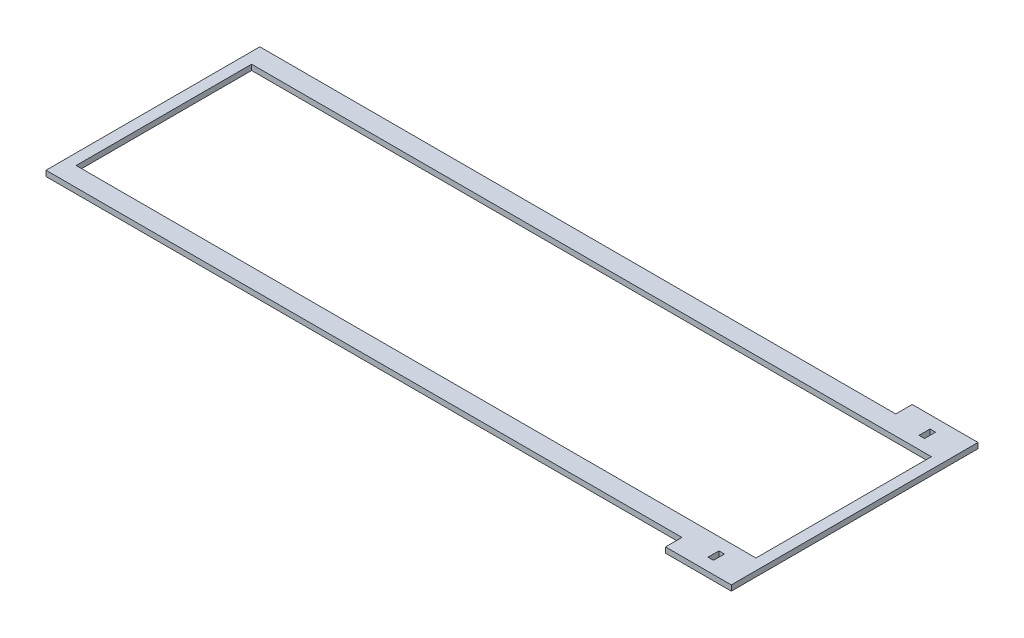
ISO-10303-21;
HEADER;
FILE_DESCRIPTION(('STEP AP214'),'2;1');
FILE_NAME('part.step','',(''),(''),'','','');
FILE_SCHEMA(('AUTOMOTIVE_DESIGN { 1 0 10303 214 1 1 1 1 }'));
ENDSEC;
DATA;
#1=APPLICATION_CONTEXT('core data for automotive mechanical design processes');
#2=APPLICATION_PROTOCOL_DEFINITION('international standard','automotive_design',2000,#1);
#3=PRODUCT_CONTEXT('',#1,'mechanical');
#4=PRODUCT('Part','Part','',(#3));
#5=PRODUCT_RELATED_PRODUCT_CATEGORY('part','',(#4));
#6=PRODUCT_DEFINITION_FORMATION('','',#4);
#7=PRODUCT_DEFINITION_CONTEXT('part definition',#1,'design');
#8=PRODUCT_DEFINITION('design','',#6,#7);
#9=PRODUCT_DEFINITION_SHAPE('','',#8);
#10=(LENGTH_UNIT() NAMED_UNIT(*) SI_UNIT(.MILLI.,.METRE.));
#11=(NAMED_UNIT(*) PLANE_ANGLE_UNIT() SI_UNIT($,.RADIAN.));
#12=(NAMED_UNIT(*) SI_UNIT($,.STERADIAN.) SOLID_ANGLE_UNIT());
#13=UNCERTAINTY_MEASURE_WITH_UNIT(LENGTH_MEASURE(1.E-05),#10,'distance_accuracy_value','');
#14=(GEOMETRIC_REPRESENTATION_CONTEXT(3) GLOBAL_UNCERTAINTY_ASSIGNED_CONTEXT((#13)) GLOBAL_UNIT_ASSIGNED_CONTEXT((#10,
#11,#12)) REPRESENTATION_CONTEXT('',''));
#15=CARTESIAN_POINT('',(0.,0.,0.));
#16=DIRECTION('',(0.,0.,1.));
#17=DIRECTION('',(1.,0.,0.));
#18=AXIS2_PLACEMENT_3D('',#15,#16,#17);
#19=CARTESIAN_POINT('',(-203.2,1.5875,0.));
#20=DIRECTION('',(1.,0.,0.));
#21=DIRECTION('',(0.,0.,-1.));
#22=AXIS2_PLACEMENT_3D('',#19,#20,#21);
#23=PLANE('',#22);
#24=DIRECTION('',(0.,0.,1.));
#25=VECTOR('',#24,1.);
#26=CARTESIAN_POINT('',(-203.2,-1.5875,0.));
#27=LINE('',#26,#25);
#28=CARTESIAN_POINT('',(-203.200000000001,-1.5875,-61.9125));
#29=VERTEX_POINT('',#28);
#30=CARTESIAN_POINT('',(-203.200000000001,-1.5875,61.9125));
#31=VERTEX_POINT('',#30);
#32=EDGE_CURVE('E247',#29,#31,#27,.T.);
#33=ORIENTED_EDGE('',*,*,#32,.T.);
#34=DIRECTION('',(0.,-1.,0.));
#35=VECTOR('',#34,1.);
#36=CARTESIAN_POINT('',(-203.200000000001,1.5875,61.9125));
#37=LINE('',#36,#35);
#38=CARTESIAN_POINT('',(-203.200000000001,1.5875,61.9125));
#39=VERTEX_POINT('',#38);
#40=EDGE_CURVE('E11',#39,#31,#37,.T.);
#41=ORIENTED_EDGE('',*,*,#40,.F.);
#42=DIRECTION('',(0.,0.,1.));
#43=VECTOR('',#42,1.);
#44=CARTESIAN_POINT('',(-203.2,1.5875,0.));
#45=LINE('',#44,#43);
#46=CARTESIAN_POINT('',(-203.200000000001,1.5875,-61.9125));
#47=VERTEX_POINT('',#46);
#48=EDGE_CURVE('E406',#47,#39,#45,.T.);
#49=ORIENTED_EDGE('',*,*,#48,.F.);
#50=DIRECTION('',(0.,-1.,0.));
#51=VECTOR('',#50,1.);
#52=CARTESIAN_POINT('',(-203.200000000001,1.5875,-61.9125));
#53=LINE('',#52,#51);
#54=EDGE_CURVE('E56',#47,#29,#53,.T.);
#55=ORIENTED_EDGE('',*,*,#54,.T.);
#56=EDGE_LOOP('',(#33,#41,#49,#55));
#57=FACE_BOUND('',#56,.T.);
#58=ADVANCED_FACE('F37',(#57),#23,.F.);
#59=CARTESIAN_POINT('',(0.,1.5875,61.9125));
#60=DIRECTION('',(0.,0.,-1.));
#61=DIRECTION('',(-1.,0.,0.));
#62=AXIS2_PLACEMENT_3D('',#59,#60,#61);
#63=PLANE('',#62);
#64=DIRECTION('',(1.,0.,0.));
#65=VECTOR('',#64,1.);
#66=CARTESIAN_POINT('',(0.,-1.5875,61.9125));
#67=LINE('',#66,#65);
#68=CARTESIAN_POINT('',(165.1,-1.5875,61.9125));
#69=VERTEX_POINT('',#68);
#70=EDGE_CURVE('E249',#31,#69,#67,.T.);
#71=ORIENTED_EDGE('',*,*,#70,.T.);
#72=DIRECTION('',(0.,-1.,0.));
#73=VECTOR('',#72,1.);
#74=CARTESIAN_POINT('',(165.1,1.5875,61.9125));
#75=LINE('',#74,#73);
#76=CARTESIAN_POINT('',(165.1,1.5875,61.9125));
#77=VERTEX_POINT('',#76);
#78=EDGE_CURVE('E47',#77,#69,#75,.T.);
#79=ORIENTED_EDGE('',*,*,#78,.F.);
#80=DIRECTION('',(1.,0.,0.));
#81=VECTOR('',#80,1.);
#82=CARTESIAN_POINT('',(0.,1.5875,61.9125));
#83=LINE('',#82,#81);
#84=EDGE_CURVE('E404',#39,#77,#83,.T.);
#85=ORIENTED_EDGE('',*,*,#84,.F.);
#86=ORIENTED_EDGE('',*,*,#40,.T.);
#87=EDGE_LOOP('',(#71,#79,#85,#86));
#88=FACE_BOUND('',#87,.T.);
#89=ADVANCED_FACE('F330',(#88),#63,.F.);
#90=CARTESIAN_POINT('',(165.1,1.5875,0.));
#91=DIRECTION('',(-1.,0.,0.));
#92=DIRECTION('',(0.,0.,1.));
#93=AXIS2_PLACEMENT_3D('',#90,#91,#92);
#94=PLANE('',#93);
#95=DIRECTION('',(0.,0.,-1.));
#96=VECTOR('',#95,1.);
#97=CARTESIAN_POINT('',(165.1,-1.5875,0.));
#98=LINE('',#97,#96);
#99=CARTESIAN_POINT('',(165.1,-1.5875,71.4375));
#100=VERTEX_POINT('',#99);
#101=EDGE_CURVE('E252',#100,#69,#98,.T.);
#102=ORIENTED_EDGE('',*,*,#101,.F.);
#103=DIRECTION('',(0.,-1.,0.));
#104=VECTOR('',#103,1.);
#105=CARTESIAN_POINT('',(165.1,1.5875,71.4375));
#106=LINE('',#105,#104);
#107=CARTESIAN_POINT('',(165.1,1.5875,71.4375));
#108=VERTEX_POINT('',#107);
#109=EDGE_CURVE('E274',#108,#100,#106,.T.);
#110=ORIENTED_EDGE('',*,*,#109,.F.);
#111=DIRECTION('',(0.,0.,-1.));
#112=VECTOR('',#111,1.);
#113=CARTESIAN_POINT('',(165.1,1.5875,0.));
#114=LINE('',#113,#112);
#115=EDGE_CURVE('E403',#108,#77,#114,.T.);
#116=ORIENTED_EDGE('',*,*,#115,.T.);
#117=ORIENTED_EDGE('',*,*,#78,.T.);
#118=EDGE_LOOP('',(#102,#110,#116,#117));
#119=FACE_BOUND('',#118,.T.);
#120=ADVANCED_FACE('F335',(#119),#94,.T.);
#121=CARTESIAN_POINT('',(0.,1.5875,71.4375));
#122=DIRECTION('',(0.,0.,-1.));
#123=DIRECTION('',(-1.,0.,0.));
#124=AXIS2_PLACEMENT_3D('',#121,#122,#123);
#125=PLANE('',#124);
#126=DIRECTION('',(1.,0.,0.));
#127=VECTOR('',#126,1.);
#128=CARTESIAN_POINT('',(0.,-1.5875,71.4375));
#129=LINE('',#128,#127);
#130=CARTESIAN_POINT('',(203.2,-1.5875,71.4375));
#131=VERTEX_POINT('',#130);
#132=EDGE_CURVE('E255',#100,#131,#129,.T.);
#133=ORIENTED_EDGE('',*,*,#132,.T.);
#134=DIRECTION('',(0.,-1.,0.));
#135=VECTOR('',#134,1.);
#136=CARTESIAN_POINT('',(203.2,1.5875,71.4375));
#137=LINE('',#136,#135);
#138=CARTESIAN_POINT('',(203.2,1.5875,71.4375));
#139=VERTEX_POINT('',#138);
#140=EDGE_CURVE('E272',#139,#131,#137,.T.);
#141=ORIENTED_EDGE('',*,*,#140,.F.);
#142=DIRECTION('',(1.,0.,0.));
#143=VECTOR('',#142,1.);
#144=CARTESIAN_POINT('',(0.,1.5875,71.4375));
#145=LINE('',#144,#143);
#146=EDGE_CURVE('E206',#108,#139,#145,.T.);
#147=ORIENTED_EDGE('',*,*,#146,.F.);
#148=ORIENTED_EDGE('',*,*,#109,.T.);
#149=EDGE_LOOP('',(#133,#141,#147,#148));
#150=FACE_BOUND('',#149,.T.);
#151=ADVANCED_FACE('F386',(#150),#125,.F.);
#152=CARTESIAN_POINT('',(203.2,1.5875,0.));
#153=DIRECTION('',(1.,0.,0.));
#154=DIRECTION('',(0.,0.,-1.));
#155=AXIS2_PLACEMENT_3D('',#152,#153,#154);
#156=PLANE('',#155);
#157=DIRECTION('',(0.,0.,1.));
#158=VECTOR('',#157,1.);
#159=CARTESIAN_POINT('',(203.2,-1.5875,0.));
#160=LINE('',#159,#158);
#161=CARTESIAN_POINT('',(203.2,-1.5875,-71.4375));
#162=VERTEX_POINT('',#161);
#163=EDGE_CURVE('E258',#162,#131,#160,.T.);
#164=ORIENTED_EDGE('',*,*,#163,.F.);
#165=DIRECTION('',(0.,-1.,0.));
#166=VECTOR('',#165,1.);
#167=CARTESIAN_POINT('',(203.2,1.5875,-71.4375));
#168=LINE('',#167,#166);
#169=CARTESIAN_POINT('',(203.2,1.5875,-71.4375));
#170=VERTEX_POINT('',#169);
#171=EDGE_CURVE('E192',#170,#162,#168,.T.);
#172=ORIENTED_EDGE('',*,*,#171,.F.);
#173=DIRECTION('',(0.,0.,1.));
#174=VECTOR('',#173,1.);
#175=CARTESIAN_POINT('',(203.2,1.5875,0.));
#176=LINE('',#175,#174);
#177=EDGE_CURVE('E204',#170,#139,#176,.T.);
#178=ORIENTED_EDGE('',*,*,#177,.T.);
#179=ORIENTED_EDGE('',*,*,#140,.T.);
#180=EDGE_LOOP('',(#164,#172,#178,#179));
#181=FACE_BOUND('',#180,.T.);
#182=ADVANCED_FACE('F383',(#181),#156,.T.);
#183=CARTESIAN_POINT('',(0.,1.5875,-71.4375));
#184=DIRECTION('',(0.,0.,-1.));
#185=DIRECTION('',(-1.,0.,0.));
#186=AXIS2_PLACEMENT_3D('',#183,#184,#185);
#187=PLANE('',#186);
#188=DIRECTION('',(1.,0.,0.));
#189=VECTOR('',#188,1.);
#190=CARTESIAN_POINT('',(0.,-1.5875,-71.4375));
#191=LINE('',#190,#189);
#192=CARTESIAN_POINT('',(165.1,-1.5875,-71.4375));
#193=VERTEX_POINT('',#192);
#194=EDGE_CURVE('E189',#193,#162,#191,.T.);
#195=ORIENTED_EDGE('',*,*,#194,.F.);
#196=DIRECTION('',(0.,-1.,0.));
#197=VECTOR('',#196,1.);
#198=CARTESIAN_POINT('',(165.1,1.5875,-71.4375));
#199=LINE('',#198,#197);
#200=CARTESIAN_POINT('',(165.1,1.5875,-71.4375));
#201=VERTEX_POINT('',#200);
#202=EDGE_CURVE('E183',#201,#193,#199,.T.);
#203=ORIENTED_EDGE('',*,*,#202,.F.);
#204=DIRECTION('',(1.,0.,0.));
#205=VECTOR('',#204,1.);
#206=CARTESIAN_POINT('',(0.,1.5875,-71.4375));
#207=LINE('',#206,#205);
#208=EDGE_CURVE('E187',#201,#170,#207,.T.);
#209=ORIENTED_EDGE('',*,*,#208,.T.);
#210=ORIENTED_EDGE('',*,*,#171,.T.);
#211=EDGE_LOOP('',(#195,#203,#209,#210));
#212=FACE_BOUND('',#211,.T.);
#213=ADVANCED_FACE('F185',(#212),#187,.T.);
#214=CARTESIAN_POINT('',(165.1,1.5875,0.));
#215=DIRECTION('',(1.,0.,0.));
#216=DIRECTION('',(0.,0.,-1.));
#217=AXIS2_PLACEMENT_3D('',#214,#215,#216);
#218=PLANE('',#217);
#219=DIRECTION('',(0.,0.,1.));
#220=VECTOR('',#219,1.);
#221=CARTESIAN_POINT('',(165.1,-1.5875,0.));
#222=LINE('',#221,#220);
#223=CARTESIAN_POINT('',(165.1,-1.5875,-61.9125));
#224=VERTEX_POINT('',#223);
#225=EDGE_CURVE('E262',#193,#224,#222,.T.);
#226=ORIENTED_EDGE('',*,*,#225,.T.);
#227=DIRECTION('',(0.,-1.,0.));
#228=VECTOR('',#227,1.);
#229=CARTESIAN_POINT('',(165.1,1.5875,-61.9125));
#230=LINE('',#229,#228);
#231=CARTESIAN_POINT('',(165.1,1.5875,-61.9125));
#232=VERTEX_POINT('',#231);
#233=EDGE_CURVE('E119',#232,#224,#230,.T.);
#234=ORIENTED_EDGE('',*,*,#233,.F.);
#235=DIRECTION('',(0.,0.,1.));
#236=VECTOR('',#235,1.);
#237=CARTESIAN_POINT('',(165.1,1.5875,0.));
#238=LINE('',#237,#236);
#239=EDGE_CURVE('E194',#201,#232,#238,.T.);
#240=ORIENTED_EDGE('',*,*,#239,.F.);
#241=ORIENTED_EDGE('',*,*,#202,.T.);
#242=EDGE_LOOP('',(#226,#234,#240,#241));
#243=FACE_BOUND('',#242,.T.);
#244=ADVANCED_FACE('F195',(#243),#218,.F.);
#245=CARTESIAN_POINT('',(185.7375,1.5875,0.));
#246=DIRECTION('',(-1.,0.,0.));
#247=DIRECTION('',(0.,0.,1.));
#248=AXIS2_PLACEMENT_3D('',#245,#246,#247);
#249=PLANE('',#248);
#250=DIRECTION('',(0.,0.,-1.));
#251=VECTOR('',#250,1.);
#252=CARTESIAN_POINT('',(185.7375,-1.5875,0.));
#253=LINE('',#252,#251);
#254=CARTESIAN_POINT('',(185.7375,-1.5875,-57.94375));
#255=VERTEX_POINT('',#254);
#256=CARTESIAN_POINT('',(185.7375,-1.5875,-64.29375));
#257=VERTEX_POINT('',#256);
#258=EDGE_CURVE('E235',#255,#257,#253,.T.);
#259=ORIENTED_EDGE('',*,*,#258,.F.);
#260=DIRECTION('',(0.,-1.,0.));
#261=VECTOR('',#260,1.);
#262=CARTESIAN_POINT('',(185.7375,1.5875,-57.94375));
#263=LINE('',#262,#261);
#264=CARTESIAN_POINT('',(185.7375,1.5875,-57.94375));
#265=VERTEX_POINT('',#264);
#266=EDGE_CURVE('E269',#265,#255,#263,.T.);
#267=ORIENTED_EDGE('',*,*,#266,.F.);
#268=DIRECTION('',(0.,0.,-1.));
#269=VECTOR('',#268,1.);
#270=CARTESIAN_POINT('',(185.7375,1.5875,0.));
#271=LINE('',#270,#269);
#272=CARTESIAN_POINT('',(185.7375,1.5875,-64.29375));
#273=VERTEX_POINT('',#272);
#274=EDGE_CURVE('E418',#265,#273,#271,.T.);
#275=ORIENTED_EDGE('',*,*,#274,.T.);
#276=DIRECTION('',(0.,-1.,0.));
#277=VECTOR('',#276,1.);
#278=CARTESIAN_POINT('',(185.7375,1.5875,-64.29375));
#279=LINE('',#278,#277);
#280=EDGE_CURVE('E277',#273,#257,#279,.T.);
#281=ORIENTED_EDGE('',*,*,#280,.T.);
#282=EDGE_LOOP('',(#259,#267,#275,#281));
#283=FACE_BOUND('',#282,.T.);
#284=ADVANCED_FACE('F348',(#283),#249,.T.);
#285=CARTESIAN_POINT('',(0.,1.5875,-57.94375));
#286=DIRECTION('',(0.,0.,1.));
#287=DIRECTION('',(1.,0.,0.));
#288=AXIS2_PLACEMENT_3D('',#285,#286,#287);
#289=PLANE('',#288);
#290=DIRECTION('',(-1.,0.,0.));
#291=VECTOR('',#290,1.);
#292=CARTESIAN_POINT('',(0.,-1.5875,-57.94375));
#293=LINE('',#292,#291);
#294=CARTESIAN_POINT('',(182.5625,-1.5875,-57.94375));
#295=VERTEX_POINT('',#294);
#296=EDGE_CURVE('E238',#255,#295,#293,.T.);
#297=ORIENTED_EDGE('',*,*,#296,.T.);
#298=DIRECTION('',(0.,-1.,0.));
#299=VECTOR('',#298,1.);
#300=CARTESIAN_POINT('',(182.5625,1.5875,-57.94375));
#301=LINE('',#300,#299);
#302=CARTESIAN_POINT('',(182.5625,1.5875,-57.94375));
#303=VERTEX_POINT('',#302);
#304=EDGE_CURVE('E282',#303,#295,#301,.T.);
#305=ORIENTED_EDGE('',*,*,#304,.F.);
#306=DIRECTION('',(-1.,0.,0.));
#307=VECTOR('',#306,1.);
#308=CARTESIAN_POINT('',(0.,1.5875,-57.94375));
#309=LINE('',#308,#307);
#310=EDGE_CURVE('E415',#265,#303,#309,.T.);
#311=ORIENTED_EDGE('',*,*,#310,.F.);
#312=ORIENTED_EDGE('',*,*,#266,.T.);
#313=EDGE_LOOP('',(#297,#305,#311,#312));
#314=FACE_BOUND('',#313,.T.);
#315=ADVANCED_FACE('F344',(#314),#289,.F.);
#316=CARTESIAN_POINT('',(182.5625,1.5875,0.));
#317=DIRECTION('',(-1.,0.,0.));
#318=DIRECTION('',(0.,0.,1.));
#319=AXIS2_PLACEMENT_3D('',#316,#317,#318);
#320=PLANE('',#319);
#321=DIRECTION('',(0.,0.,-1.));
#322=VECTOR('',#321,1.);
#323=CARTESIAN_POINT('',(182.5625,-1.5875,0.));
#324=LINE('',#323,#322);
#325=CARTESIAN_POINT('',(182.5625,-1.5875,-64.29375));
#326=VERTEX_POINT('',#325);
#327=EDGE_CURVE('E241',#295,#326,#324,.T.);
#328=ORIENTED_EDGE('',*,*,#327,.T.);
#329=DIRECTION('',(0.,-1.,0.));
#330=VECTOR('',#329,1.);
#331=CARTESIAN_POINT('',(182.5625,1.5875,-64.29375));
#332=LINE('',#331,#330);
#333=CARTESIAN_POINT('',(182.5625,1.5875,-64.29375));
#334=VERTEX_POINT('',#333);
#335=EDGE_CURVE('E279',#334,#326,#332,.T.);
#336=ORIENTED_EDGE('',*,*,#335,.F.);
#337=DIRECTION('',(0.,0.,-1.));
#338=VECTOR('',#337,1.);
#339=CARTESIAN_POINT('',(182.5625,1.5875,0.));
#340=LINE('',#339,#338);
#341=EDGE_CURVE('E413',#303,#334,#340,.T.);
#342=ORIENTED_EDGE('',*,*,#341,.F.);
#343=ORIENTED_EDGE('',*,*,#304,.T.);
#344=EDGE_LOOP('',(#328,#336,#342,#343));
#345=FACE_BOUND('',#344,.T.);
#346=ADVANCED_FACE('F340',(#345),#320,.F.);
#347=CARTESIAN_POINT('',(182.5625,1.5875,0.));
#348=DIRECTION('',(1.,0.,0.));
#349=DIRECTION('',(0.,0.,-1.));
#350=AXIS2_PLACEMENT_3D('',#347,#348,#349);
#351=PLANE('',#350);
#352=DIRECTION('',(0.,0.,1.));
#353=VECTOR('',#352,1.);
#354=CARTESIAN_POINT('',(182.5625,-1.5875,0.));
#355=LINE('',#354,#353);
#356=CARTESIAN_POINT('',(182.5625,-1.5875,57.94375));
#357=VERTEX_POINT('',#356);
#358=CARTESIAN_POINT('',(182.5625,-1.5875,64.29375));
#359=VERTEX_POINT('',#358);
#360=EDGE_CURVE('E223',#357,#359,#355,.T.);
#361=ORIENTED_EDGE('',*,*,#360,.F.);
#362=DIRECTION('',(0.,-1.,0.));
#363=VECTOR('',#362,1.);
#364=CARTESIAN_POINT('',(182.5625,1.5875,57.94375));
#365=LINE('',#364,#363);
#366=CARTESIAN_POINT('',(182.5625,1.5875,57.94375));
#367=VERTEX_POINT('',#366);
#368=EDGE_CURVE('E280',#367,#357,#365,.T.);
#369=ORIENTED_EDGE('',*,*,#368,.F.);
#370=DIRECTION('',(0.,0.,1.));
#371=VECTOR('',#370,1.);
#372=CARTESIAN_POINT('',(182.5625,1.5875,0.));
#373=LINE('',#372,#371);
#374=CARTESIAN_POINT('',(182.5625,1.5875,64.29375));
#375=VERTEX_POINT('',#374);
#376=EDGE_CURVE('E429',#367,#375,#373,.T.);
#377=ORIENTED_EDGE('',*,*,#376,.T.);
#378=DIRECTION('',(0.,-1.,0.));
#379=VECTOR('',#378,1.);
#380=CARTESIAN_POINT('',(182.5625,1.5875,64.29375));
#381=LINE('',#380,#379);
#382=EDGE_CURVE('E286',#375,#359,#381,.T.);
#383=ORIENTED_EDGE('',*,*,#382,.T.);
#384=EDGE_LOOP('',(#361,#369,#377,#383));
#385=FACE_BOUND('',#384,.T.);
#386=ADVANCED_FACE('F343',(#385),#351,.T.);
#387=CARTESIAN_POINT('',(0.,1.5875,57.94375));
#388=DIRECTION('',(0.,0.,1.));
#389=DIRECTION('',(1.,0.,0.));
#390=AXIS2_PLACEMENT_3D('',#387,#388,#389);
#391=PLANE('',#390);
#392=DIRECTION('',(-1.,0.,0.));
#393=VECTOR('',#392,1.);
#394=CARTESIAN_POINT('',(0.,-1.5875,57.94375));
#395=LINE('',#394,#393);
#396=CARTESIAN_POINT('',(185.7375,-1.5875,57.94375));
#397=VERTEX_POINT('',#396);
#398=EDGE_CURVE('E226',#397,#357,#395,.T.);
#399=ORIENTED_EDGE('',*,*,#398,.F.);
#400=DIRECTION('',(0.,-1.,0.));
#401=VECTOR('',#400,1.);
#402=CARTESIAN_POINT('',(185.7375,1.5875,57.94375));
#403=LINE('',#402,#401);
#404=CARTESIAN_POINT('',(185.7375,1.5875,57.94375));
#405=VERTEX_POINT('',#404);
#406=EDGE_CURVE('E291',#405,#397,#403,.T.);
#407=ORIENTED_EDGE('',*,*,#406,.F.);
#408=DIRECTION('',(-1.,0.,0.));
#409=VECTOR('',#408,1.);
#410=CARTESIAN_POINT('',(0.,1.5875,57.94375));
#411=LINE('',#410,#409);
#412=EDGE_CURVE('E426',#405,#367,#411,.T.);
#413=ORIENTED_EDGE('',*,*,#412,.T.);
#414=ORIENTED_EDGE('',*,*,#368,.T.);
#415=EDGE_LOOP('',(#399,#407,#413,#414));
#416=FACE_BOUND('',#415,.T.);
#417=ADVANCED_FACE('F359',(#416),#391,.T.);
#418=CARTESIAN_POINT('',(185.7375,1.5875,0.));
#419=DIRECTION('',(1.,0.,0.));
#420=DIRECTION('',(0.,0.,-1.));
#421=AXIS2_PLACEMENT_3D('',#418,#419,#420);
#422=PLANE('',#421);
#423=DIRECTION('',(0.,0.,1.));
#424=VECTOR('',#423,1.);
#425=CARTESIAN_POINT('',(185.7375,-1.5875,0.));
#426=LINE('',#425,#424);
#427=CARTESIAN_POINT('',(185.7375,-1.5875,64.29375));
#428=VERTEX_POINT('',#427);
#429=EDGE_CURVE('E229',#397,#428,#426,.T.);
#430=ORIENTED_EDGE('',*,*,#429,.T.);
#431=DIRECTION('',(0.,-1.,0.));
#432=VECTOR('',#431,1.);
#433=CARTESIAN_POINT('',(185.7375,1.5875,64.29375));
#434=LINE('',#433,#432);
#435=CARTESIAN_POINT('',(185.7375,1.5875,64.29375));
#436=VERTEX_POINT('',#435);
#437=EDGE_CURVE('E288',#436,#428,#434,.T.);
#438=ORIENTED_EDGE('',*,*,#437,.F.);
#439=DIRECTION('',(0.,0.,1.));
#440=VECTOR('',#439,1.);
#441=CARTESIAN_POINT('',(185.7375,1.5875,0.));
#442=LINE('',#441,#440);
#443=EDGE_CURVE('E423',#405,#436,#442,.T.);
#444=ORIENTED_EDGE('',*,*,#443,.F.);
#445=ORIENTED_EDGE('',*,*,#406,.T.);
#446=EDGE_LOOP('',(#430,#438,#444,#445));
#447=FACE_BOUND('',#446,.T.);
#448=ADVANCED_FACE('F356',(#447),#422,.F.);
#449=CARTESIAN_POINT('',(0.,1.5875,-50.8));
#450=DIRECTION('',(0.,0.,1.));
#451=DIRECTION('',(1.,0.,0.));
#452=AXIS2_PLACEMENT_3D('',#449,#450,#451);
#453=PLANE('',#452);
#454=DIRECTION('',(-1.,0.,0.));
#455=VECTOR('',#454,1.);
#456=CARTESIAN_POINT('',(0.,-1.5875,-50.8));
#457=LINE('',#456,#455);
#458=CARTESIAN_POINT('',(196.85,-1.5875,-50.8));
#459=VERTEX_POINT('',#458);
#460=CARTESIAN_POINT('',(-196.85,-1.5875,-50.7999999999999));
#461=VERTEX_POINT('',#460);
#462=EDGE_CURVE('E212',#459,#461,#457,.T.);
#463=ORIENTED_EDGE('',*,*,#462,.F.);
#464=DIRECTION('',(0.,-1.,0.));
#465=VECTOR('',#464,1.);
#466=CARTESIAN_POINT('',(196.85,1.5875,-50.8));
#467=LINE('',#466,#465);
#468=CARTESIAN_POINT('',(196.85,1.5875,-50.8));
#469=VERTEX_POINT('',#468);
#470=EDGE_CURVE('E41',#469,#459,#467,.T.);
#471=ORIENTED_EDGE('',*,*,#470,.F.);
#472=DIRECTION('',(-1.,0.,0.));
#473=VECTOR('',#472,1.);
#474=CARTESIAN_POINT('',(0.,1.5875,-50.8));
#475=LINE('',#474,#473);
#476=CARTESIAN_POINT('',(-196.85,1.5875,-50.7999999999999));
#477=VERTEX_POINT('',#476);
#478=EDGE_CURVE('E267',#469,#477,#475,.T.);
#479=ORIENTED_EDGE('',*,*,#478,.T.);
#480=DIRECTION('',(0.,-1.,0.));
#481=VECTOR('',#480,1.);
#482=CARTESIAN_POINT('',(-196.85,1.5875,-50.7999999999999));
#483=LINE('',#482,#481);
#484=EDGE_CURVE('E211',#477,#461,#483,.T.);
#485=ORIENTED_EDGE('',*,*,#484,.T.);
#486=EDGE_LOOP('',(#463,#471,#479,#485));
#487=FACE_BOUND('',#486,.T.);
#488=ADVANCED_FACE('F39',(#487),#453,.T.);
#489=CARTESIAN_POINT('',(196.85,1.5875,0.));
#490=DIRECTION('',(1.,0.,0.));
#491=DIRECTION('',(0.,0.,-1.));
#492=AXIS2_PLACEMENT_3D('',#489,#490,#491);
#493=PLANE('',#492);
#494=DIRECTION('',(0.,0.,1.));
#495=VECTOR('',#494,1.);
#496=CARTESIAN_POINT('',(196.85,-1.5875,0.));
#497=LINE('',#496,#495);
#498=CARTESIAN_POINT('',(196.85,-1.5875,50.8));
#499=VERTEX_POINT('',#498);
#500=EDGE_CURVE('E215',#459,#499,#497,.T.);
#501=ORIENTED_EDGE('',*,*,#500,.T.);
#502=DIRECTION('',(0.,-1.,0.));
#503=VECTOR('',#502,1.);
#504=CARTESIAN_POINT('',(196.85,1.5875,50.8));
#505=LINE('',#504,#503);
#506=CARTESIAN_POINT('',(196.85,1.5875,50.8));
#507=VERTEX_POINT('',#506);
#508=EDGE_CURVE('E296',#507,#499,#505,.T.);
#509=ORIENTED_EDGE('',*,*,#508,.F.);
#510=DIRECTION('',(0.,0.,1.));
#511=VECTOR('',#510,1.);
#512=CARTESIAN_POINT('',(196.85,1.5875,0.));
#513=LINE('',#512,#511);
#514=EDGE_CURVE('E305',#469,#507,#513,.T.);
#515=ORIENTED_EDGE('',*,*,#514,.F.);
#516=ORIENTED_EDGE('',*,*,#470,.T.);
#517=EDGE_LOOP('',(#501,#509,#515,#516));
#518=FACE_BOUND('',#517,.T.);
#519=ADVANCED_FACE('F304',(#518),#493,.F.);
#520=CARTESIAN_POINT('',(0.,1.5875,50.8000000000001));
#521=DIRECTION('',(0.,0.,1.));
#522=DIRECTION('',(1.,0.,0.));
#523=AXIS2_PLACEMENT_3D('',#520,#521,#522);
#524=PLANE('',#523);
#525=DIRECTION('',(-1.,0.,0.));
#526=VECTOR('',#525,1.);
#527=CARTESIAN_POINT('',(0.,-1.5875,50.8000000000001));
#528=LINE('',#527,#526);
#529=CARTESIAN_POINT('',(-196.85,-1.5875,50.8000000000002));
#530=VERTEX_POINT('',#529);
#531=EDGE_CURVE('E217',#499,#530,#528,.T.);
#532=ORIENTED_EDGE('',*,*,#531,.T.);
#533=DIRECTION('',(0.,-1.,0.));
#534=VECTOR('',#533,1.);
#535=CARTESIAN_POINT('',(-196.85,1.5875,50.8000000000002));
#536=LINE('',#535,#534);
#537=CARTESIAN_POINT('',(-196.85,1.5875,50.8000000000002));
#538=VERTEX_POINT('',#537);
#539=EDGE_CURVE('E295',#538,#530,#536,.T.);
#540=ORIENTED_EDGE('',*,*,#539,.F.);
#541=DIRECTION('',(-1.,0.,0.));
#542=VECTOR('',#541,1.);
#543=CARTESIAN_POINT('',(0.,1.5875,50.8000000000001));
#544=LINE('',#543,#542);
#545=EDGE_CURVE('E433',#507,#538,#544,.T.);
#546=ORIENTED_EDGE('',*,*,#545,.F.);
#547=ORIENTED_EDGE('',*,*,#508,.T.);
#548=EDGE_LOOP('',(#532,#540,#546,#547));
#549=FACE_BOUND('',#548,.T.);
#550=ADVANCED_FACE('F317',(#549),#524,.F.);
#551=CARTESIAN_POINT('',(0.,1.5875,-64.29375));
#552=DIRECTION('',(0.,0.,1.));
#553=DIRECTION('',(1.,0.,0.));
#554=AXIS2_PLACEMENT_3D('',#551,#552,#553);
#555=PLANE('',#554);
#556=DIRECTION('',(-1.,0.,0.));
#557=VECTOR('',#556,1.);
#558=CARTESIAN_POINT('',(0.,-1.5875,-64.29375));
#559=LINE('',#558,#557);
#560=EDGE_CURVE('E244',#257,#326,#559,.T.);
#561=ORIENTED_EDGE('',*,*,#560,.F.);
#562=ORIENTED_EDGE('',*,*,#280,.F.);
#563=DIRECTION('',(-1.,0.,0.));
#564=VECTOR('',#563,1.);
#565=CARTESIAN_POINT('',(0.,1.5875,-64.29375));
#566=LINE('',#565,#564);
#567=EDGE_CURVE('E410',#273,#334,#566,.T.);
#568=ORIENTED_EDGE('',*,*,#567,.T.);
#569=ORIENTED_EDGE('',*,*,#335,.T.);
#570=EDGE_LOOP('',(#561,#562,#568,#569));
#571=FACE_BOUND('',#570,.T.);
#572=ADVANCED_FACE('F319',(#571),#555,.T.);
#573=CARTESIAN_POINT('',(0.,1.5875,64.29375));
#574=DIRECTION('',(0.,0.,1.));
#575=DIRECTION('',(1.,0.,0.));
#576=AXIS2_PLACEMENT_3D('',#573,#574,#575);
#577=PLANE('',#576);
#578=DIRECTION('',(-1.,0.,0.));
#579=VECTOR('',#578,1.);
#580=CARTESIAN_POINT('',(0.,-1.5875,64.29375));
#581=LINE('',#580,#579);
#582=EDGE_CURVE('E232',#428,#359,#581,.T.);
#583=ORIENTED_EDGE('',*,*,#582,.T.);
#584=ORIENTED_EDGE('',*,*,#382,.F.);
#585=DIRECTION('',(-1.,0.,0.));
#586=VECTOR('',#585,1.);
#587=CARTESIAN_POINT('',(0.,1.5875,64.29375));
#588=LINE('',#587,#586);
#589=EDGE_CURVE('E421',#436,#375,#588,.T.);
#590=ORIENTED_EDGE('',*,*,#589,.F.);
#591=ORIENTED_EDGE('',*,*,#437,.T.);
#592=EDGE_LOOP('',(#583,#584,#590,#591));
#593=FACE_BOUND('',#592,.T.);
#594=ADVANCED_FACE('F325',(#593),#577,.F.);
#595=CARTESIAN_POINT('',(-196.85,1.5875,0.));
#596=DIRECTION('',(1.,0.,0.));
#597=DIRECTION('',(0.,0.,-1.));
#598=AXIS2_PLACEMENT_3D('',#595,#596,#597);
#599=PLANE('',#598);
#600=DIRECTION('',(0.,0.,1.));
#601=VECTOR('',#600,1.);
#602=CARTESIAN_POINT('',(-196.85,-1.5875,0.));
#603=LINE('',#602,#601);
#604=EDGE_CURVE('E220',#461,#530,#603,.T.);
#605=ORIENTED_EDGE('',*,*,#604,.F.);
#606=ORIENTED_EDGE('',*,*,#484,.F.);
#607=DIRECTION('',(0.,0.,1.));
#608=VECTOR('',#607,1.);
#609=CARTESIAN_POINT('',(-196.85,1.5875,0.));
#610=LINE('',#609,#608);
#611=EDGE_CURVE('E315',#477,#538,#610,.T.);
#612=ORIENTED_EDGE('',*,*,#611,.T.);
#613=ORIENTED_EDGE('',*,*,#539,.T.);
#614=EDGE_LOOP('',(#605,#606,#612,#613));
#615=FACE_BOUND('',#614,.T.);
#616=ADVANCED_FACE('F314',(#615),#599,.T.);
#617=CARTESIAN_POINT('',(0.,1.5875,-61.9125));
#618=DIRECTION('',(0.,0.,-1.));
#619=DIRECTION('',(-1.,0.,0.));
#620=AXIS2_PLACEMENT_3D('',#617,#618,#619);
#621=PLANE('',#620);
#622=DIRECTION('',(1.,0.,0.));
#623=VECTOR('',#622,1.);
#624=CARTESIAN_POINT('',(0.,-1.5875,-61.9125));
#625=LINE('',#624,#623);
#626=EDGE_CURVE('E264',#29,#224,#625,.T.);
#627=ORIENTED_EDGE('',*,*,#626,.F.);
#628=ORIENTED_EDGE('',*,*,#54,.F.);
#629=DIRECTION('',(1.,0.,0.));
#630=VECTOR('',#629,1.);
#631=CARTESIAN_POINT('',(0.,1.5875,-61.9125));
#632=LINE('',#631,#630);
#633=EDGE_CURVE('E198',#47,#232,#632,.T.);
#634=ORIENTED_EDGE('',*,*,#633,.T.);
#635=ORIENTED_EDGE('',*,*,#233,.T.);
#636=EDGE_LOOP('',(#627,#628,#634,#635));
#637=FACE_BOUND('',#636,.T.);
#638=ADVANCED_FACE('F367',(#637),#621,.T.);
#639=CARTESIAN_POINT('',(0.,1.5875,0.));
#640=DIRECTION('',(0.,1.,0.));
#641=DIRECTION('',(0.,0.,1.));
#642=AXIS2_PLACEMENT_3D('',#639,#640,#641);
#643=PLANE('',#642);
#644=ORIENTED_EDGE('',*,*,#478,.F.);
#645=ORIENTED_EDGE('',*,*,#514,.T.);
#646=ORIENTED_EDGE('',*,*,#545,.T.);
#647=ORIENTED_EDGE('',*,*,#611,.F.);
#648=EDGE_LOOP('',(#644,#645,#646,#647));
#649=FACE_BOUND('',#648,.T.);
#650=ORIENTED_EDGE('',*,*,#376,.F.);
#651=ORIENTED_EDGE('',*,*,#412,.F.);
#652=ORIENTED_EDGE('',*,*,#443,.T.);
#653=ORIENTED_EDGE('',*,*,#589,.T.);
#654=EDGE_LOOP('',(#650,#651,#652,#653));
#655=FACE_BOUND('',#654,.T.);
#656=ORIENTED_EDGE('',*,*,#274,.F.);
#657=ORIENTED_EDGE('',*,*,#310,.T.);
#658=ORIENTED_EDGE('',*,*,#341,.T.);
#659=ORIENTED_EDGE('',*,*,#567,.F.);
#660=EDGE_LOOP('',(#656,#657,#658,#659));
#661=FACE_BOUND('',#660,.T.);
#662=ORIENTED_EDGE('',*,*,#48,.T.);
#663=ORIENTED_EDGE('',*,*,#84,.T.);
#664=ORIENTED_EDGE('',*,*,#115,.F.);
#665=ORIENTED_EDGE('',*,*,#146,.T.);
#666=ORIENTED_EDGE('',*,*,#177,.F.);
#667=ORIENTED_EDGE('',*,*,#208,.F.);
#668=ORIENTED_EDGE('',*,*,#239,.T.);
#669=ORIENTED_EDGE('',*,*,#633,.F.);
#670=EDGE_LOOP('',(#662,#663,#664,#665,#666,#667,#668,#669));
#671=FACE_BOUND('',#670,.T.);
#672=ADVANCED_FACE('F202',(#649,#655,#661,#671),#643,.T.);
#673=CARTESIAN_POINT('',(0.,-1.5875,0.));
#674=DIRECTION('',(0.,1.,0.));
#675=DIRECTION('',(0.,0.,1.));
#676=AXIS2_PLACEMENT_3D('',#673,#674,#675);
#677=PLANE('',#676);
#678=ORIENTED_EDGE('',*,*,#462,.T.);
#679=ORIENTED_EDGE('',*,*,#604,.T.);
#680=ORIENTED_EDGE('',*,*,#531,.F.);
#681=ORIENTED_EDGE('',*,*,#500,.F.);
#682=EDGE_LOOP('',(#678,#679,#680,#681));
#683=FACE_BOUND('',#682,.T.);
#684=ORIENTED_EDGE('',*,*,#360,.T.);
#685=ORIENTED_EDGE('',*,*,#582,.F.);
#686=ORIENTED_EDGE('',*,*,#429,.F.);
#687=ORIENTED_EDGE('',*,*,#398,.T.);
#688=EDGE_LOOP('',(#684,#685,#686,#687));
#689=FACE_BOUND('',#688,.T.);
#690=ORIENTED_EDGE('',*,*,#258,.T.);
#691=ORIENTED_EDGE('',*,*,#560,.T.);
#692=ORIENTED_EDGE('',*,*,#327,.F.);
#693=ORIENTED_EDGE('',*,*,#296,.F.);
#694=EDGE_LOOP('',(#690,#691,#692,#693));
#695=FACE_BOUND('',#694,.T.);
#696=ORIENTED_EDGE('',*,*,#32,.F.);
#697=ORIENTED_EDGE('',*,*,#626,.T.);
#698=ORIENTED_EDGE('',*,*,#225,.F.);
#699=ORIENTED_EDGE('',*,*,#194,.T.);
#700=ORIENTED_EDGE('',*,*,#163,.T.);
#701=ORIENTED_EDGE('',*,*,#132,.F.);
#702=ORIENTED_EDGE('',*,*,#101,.T.);
#703=ORIENTED_EDGE('',*,*,#70,.F.);
#704=EDGE_LOOP('',(#696,#697,#698,#699,#700,#701,#702,#703));
#705=FACE_BOUND('',#704,.T.);
#706=ADVANCED_FACE('F308',(#683,#689,#695,#705),#677,.F.);
#707=CLOSED_SHELL('',(#58,#89,#120,#151,#182,#213,#244,#284,#315,#346,#386,#417,#448,#488,#519,
#550,#572,#594,#616,#638,#672,#706));
#708=MANIFOLD_SOLID_BREP('B2',#707);
#709=ADVANCED_BREP_SHAPE_REPRESENTATION('',(#18,#708),#14);
#710=SHAPE_DEFINITION_REPRESENTATION(#9,#709);
ENDSEC;
END-ISO-10303-21;
